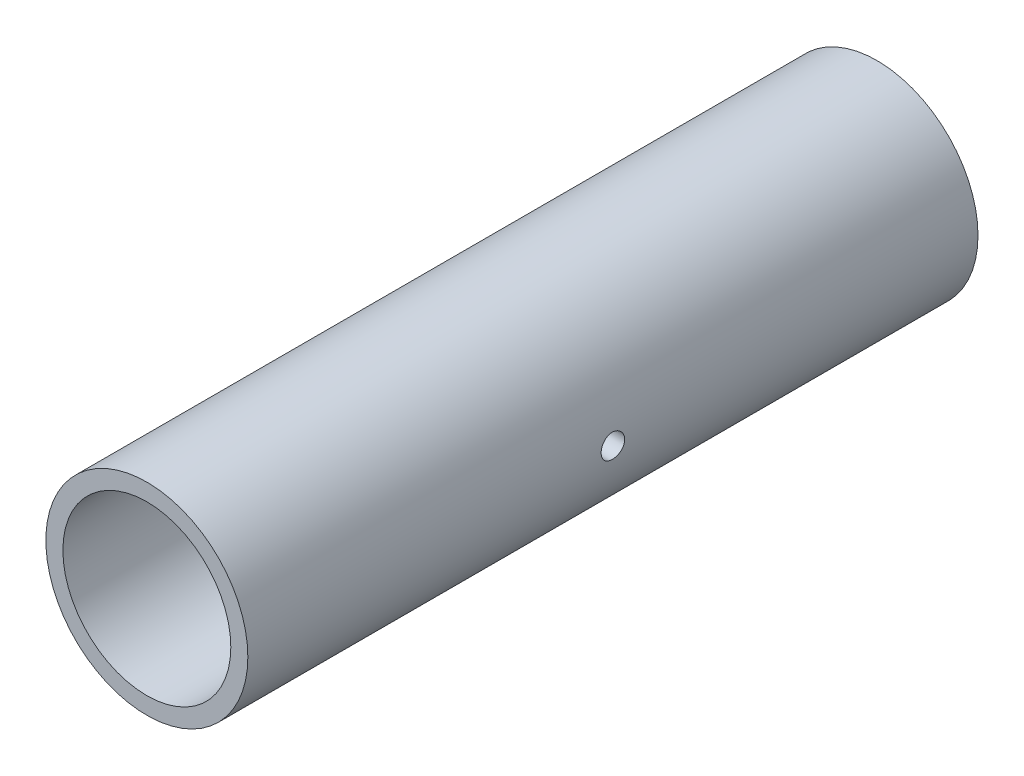
ISO-10303-21;
HEADER;
FILE_DESCRIPTION(('STEP AP214'),'2;1');
FILE_NAME('part.step','',(''),(''),'','','');
FILE_SCHEMA(('AUTOMOTIVE_DESIGN { 1 0 10303 214 1 1 1 1 }'));
ENDSEC;
DATA;
#1=APPLICATION_CONTEXT('core data for automotive mechanical design processes');
#2=APPLICATION_PROTOCOL_DEFINITION('international standard','automotive_design',2000,#1);
#3=PRODUCT_CONTEXT('',#1,'mechanical');
#4=PRODUCT('Part','Part','',(#3));
#5=PRODUCT_RELATED_PRODUCT_CATEGORY('part','',(#4));
#6=PRODUCT_DEFINITION_FORMATION('','',#4);
#7=PRODUCT_DEFINITION_CONTEXT('part definition',#1,'design');
#8=PRODUCT_DEFINITION('design','',#6,#7);
#9=PRODUCT_DEFINITION_SHAPE('','',#8);
#10=(LENGTH_UNIT() NAMED_UNIT(*) SI_UNIT(.MILLI.,.METRE.));
#11=(NAMED_UNIT(*) PLANE_ANGLE_UNIT() SI_UNIT($,.RADIAN.));
#12=(NAMED_UNIT(*) SI_UNIT($,.STERADIAN.) SOLID_ANGLE_UNIT());
#13=UNCERTAINTY_MEASURE_WITH_UNIT(LENGTH_MEASURE(1.E-05),#10,'distance_accuracy_value','');
#14=(GEOMETRIC_REPRESENTATION_CONTEXT(3) GLOBAL_UNCERTAINTY_ASSIGNED_CONTEXT((#13)) GLOBAL_UNIT_ASSIGNED_CONTEXT((#10,
#11,#12)) REPRESENTATION_CONTEXT('',''));
#15=CARTESIAN_POINT('',(0.,0.,0.));
#16=DIRECTION('',(0.,0.,1.));
#17=DIRECTION('',(1.,0.,0.));
#18=AXIS2_PLACEMENT_3D('',#15,#16,#17);
#19=CARTESIAN_POINT('',(-101.6,0.,152.402));
#20=DIRECTION('',(0.,0.,1.));
#21=DIRECTION('',(1.,0.,0.));
#22=AXIS2_PLACEMENT_3D('',#19,#20,#21);
#23=CYLINDRICAL_SURFACE('',#22,17.526);
#24=CARTESIAN_POINT('',(-119.123715355355,0.28297728617745,78.6411031026992));
#25=CARTESIAN_POINT('',(-119.121505128707,0.419725387709833,78.6252451869688));
#26=CARTESIAN_POINT('',(-119.117701917003,0.55519634107018,78.5978624196119));
#27=CARTESIAN_POINT('',(-119.107325190727,0.819641914327255,78.5208303913292));
#28=CARTESIAN_POINT('',(-119.100748768076,0.948609555237474,78.4711577530024));
#29=CARTESIAN_POINT('',(-119.085567784651,1.19623497759444,78.351045765692));
#30=CARTESIAN_POINT('',(-119.07696478105,1.3149005795334,78.2806223507067));
#31=CARTESIAN_POINT('',(-119.058683604987,1.53872445538153,78.1210105871433));
#32=CARTESIAN_POINT('',(-119.049005613146,1.64388499204596,78.0318253886998));
#33=CARTESIAN_POINT('',(-119.02958562624,1.83843862258968,77.8365553481983));
#34=CARTESIAN_POINT('',(-119.019843601335,1.92773147696729,77.7303706023728));
#35=CARTESIAN_POINT('',(-119.001451897443,2.08725094028072,77.504441243093));
#36=CARTESIAN_POINT('',(-118.992802250694,2.15747698658327,77.384696229643));
#37=CARTESIAN_POINT('',(-118.977577993425,2.27686193748739,77.1349453244671));
#38=CARTESIAN_POINT('',(-118.971004142651,2.32601313099119,77.0049356975797));
#39=CARTESIAN_POINT('',(-118.960696061729,2.40174584599649,76.7383948893738));
#40=CARTESIAN_POINT('',(-118.956961657328,2.42832875249076,76.6018641087952));
#41=CARTESIAN_POINT('',(-118.952786075787,2.45799054285402,76.327406279144));
#42=CARTESIAN_POINT('',(-118.952317026263,2.46126835922658,76.1895011353762));
#43=CARTESIAN_POINT('',(-118.954652238211,2.44474718479965,75.9151118442297));
#44=CARTESIAN_POINT('',(-118.957456409832,2.42494882745929,75.7786276579483));
#45=CARTESIAN_POINT('',(-118.965997166519,2.36300228421005,75.5115225938979));
#46=CARTESIAN_POINT('',(-118.971721693318,2.32094597577758,75.3808799897539));
#47=CARTESIAN_POINT('',(-118.985449015432,2.21576961423337,75.1284974499377));
#48=CARTESIAN_POINT('',(-118.993451914927,2.15264859790917,75.0067579216812));
#49=CARTESIAN_POINT('',(-119.010902012579,2.00663639659153,74.7747327311101));
#50=CARTESIAN_POINT('',(-119.020358625173,1.92361421340849,74.6645302238158));
#51=CARTESIAN_POINT('',(-119.039619790398,1.740346604452,74.4595526320331));
#52=CARTESIAN_POINT('',(-119.04942435956,1.64010035951873,74.3647782817107));
#53=CARTESIAN_POINT('',(-119.068360383365,1.42437560126186,74.19266657615));
#54=CARTESIAN_POINT('',(-119.077486575457,1.30879417604439,74.1154575511887));
#55=CARTESIAN_POINT('',(-119.093961421427,1.0661856150858,73.9815536036244));
#56=CARTESIAN_POINT('',(-119.101310119849,0.939158766274965,73.9248581669359));
#57=CARTESIAN_POINT('',(-119.113378473563,0.677716930934977,73.833810640891));
#58=CARTESIAN_POINT('',(-119.118107316093,0.543329601894206,73.7993804005794));
#59=CARTESIAN_POINT('',(-119.124441162939,0.270611487492154,73.7535852573418));
#60=CARTESIAN_POINT('',(-119.126046350755,0.132280934262034,73.7422189995086));
#61=CARTESIAN_POINT('',(-119.125951986942,-0.143137402694307,73.7428928519706));
#62=CARTESIAN_POINT('',(-119.124280497334,-0.280225725804454,73.7547342081212));
#63=CARTESIAN_POINT('',(-119.117875469495,-0.55044219661083,73.8010700059227));
#64=CARTESIAN_POINT('',(-119.113141935451,-0.683570349722479,73.8355644165946));
#65=CARTESIAN_POINT('',(-119.101140462198,-0.942077880844908,73.9261697607615));
#66=CARTESIAN_POINT('',(-119.093873353741,-1.06745978297961,73.9822736092281));
#67=CARTESIAN_POINT('',(-119.077605395029,-1.30706714498407,74.1144876246053));
#68=CARTESIAN_POINT('',(-119.068604449357,-1.42129199032536,74.1905988926692));
#69=CARTESIAN_POINT('',(-119.049777850375,-1.63636768818757,74.3614197407177));
#70=CARTESIAN_POINT('',(-119.039945929669,-1.73709870764936,74.4562795323442));
#71=CARTESIAN_POINT('',(-119.020620344086,-1.92126473598738,74.661553664412));
#72=CARTESIAN_POINT('',(-119.011126689633,-2.0046992122227,74.7719684836891));
#73=CARTESIAN_POINT('',(-118.993507369542,-2.15224104275118,75.0058015387639));
#74=CARTESIAN_POINT('',(-118.98538769137,-2.2162647216069,75.1292730616549));
#75=CARTESIAN_POINT('',(-118.971498120692,-2.32263301614465,75.3853491681182));
#76=CARTESIAN_POINT('',(-118.965728112698,-2.36497869733554,75.5179533024444));
#77=CARTESIAN_POINT('',(-118.957236378841,-2.42651802383966,75.7876052800066));
#78=CARTESIAN_POINT('',(-118.954494837915,-2.44586223076695,75.9246181273913));
#79=CARTESIAN_POINT('',(-118.952310159854,-2.46131525653618,76.1999710553356));
#80=CARTESIAN_POINT('',(-118.952866869435,-2.45742515516648,76.3383110739181));
#81=CARTESIAN_POINT('',(-118.957197628053,-2.42664350766508,76.6113399658756));
#82=CARTESIAN_POINT('',(-118.960948475202,-2.39991783209861,76.7460479601579));
#83=CARTESIAN_POINT('',(-118.971208792187,-2.32448219119439,77.0090485050365));
#84=CARTESIAN_POINT('',(-118.977718331456,-2.27577167252249,77.1373408940688));
#85=CARTESIAN_POINT('',(-118.992789013397,-2.15757050917418,77.3843846643752));
#86=CARTESIAN_POINT('',(-119.00135725346,-2.08800776619924,77.5031010986397));
#87=CARTESIAN_POINT('',(-119.019574195805,-1.93013073629695,77.7272354511105));
#88=CARTESIAN_POINT('',(-119.029222927516,-1.84181593856106,77.8326530069289));
#89=CARTESIAN_POINT('',(-119.048616139759,-1.64803310294449,78.0281557234962));
#90=CARTESIAN_POINT('',(-119.058360727993,-1.54242360941094,78.1181007138414));
#91=CARTESIAN_POINT('',(-119.076772073305,-1.3175064853285,78.2790284888199));
#92=CARTESIAN_POINT('',(-119.085438606464,-1.19819601886243,78.3500073375654));
#93=CARTESIAN_POINT('',(-119.100725507981,-0.949133614688026,78.4709900023214));
#94=CARTESIAN_POINT('',(-119.107344122617,-0.819372847099269,78.5209758541373));
#95=CARTESIAN_POINT('',(-119.117768969297,-0.553273149397818,78.5983551413155));
#96=CARTESIAN_POINT('',(-119.12157822312,-0.416941455751361,78.6257728549007));
#97=CARTESIAN_POINT('',(-119.125262958391,-0.186002191422685,78.6522049553093));
#98=CARTESIAN_POINT('',(-119.126009745135,-0.0920821068849606,78.6575194540336));
#99=CARTESIAN_POINT('',(-119.125990063029,0.0957493223237467,78.6573791778342));
#100=CARTESIAN_POINT('',(-119.125223609408,0.18966066707318,78.6519245112995));
#101=CARTESIAN_POINT('',(-119.123715355355,0.28297728617745,78.6411031026992));
#102=B_SPLINE_CURVE_WITH_KNOTS('',3,(#24,#25,#26,#27,#28,#29,#30,#31,#32,#33,#34,#35,#36,#37,
#38,#39,#40,#41,#42,#43,#44,#45,#46,#47,#48,#49,#50,#51,#52,#53,#54,#55,#56,#57,#58,#59,#60,#61,
#62,#63,#64,#65,#66,#67,#68,#69,#70,#71,#72,#73,#74,#75,#76,#77,#78,#79,#80,#81,#82,#83,#84,#85,
#86,#87,#88,#89,#90,#91,#92,#93,#94,#95,#96,#97,#98,#99,#100,#101),.UNSPECIFIED.,.T.,.F.,(4,2,2,
2,2,2,2,2,2,2,2,2,2,2,2,2,2,2,2,2,2,2,2,2,2,2,2,2,2,2,2,2,2,2,2,2,2,2,4),(0.,0.412702421936888,
0.825838697502058,1.23865855919966,1.65140916300135,2.06668105728181,2.48196520428906,
2.89740117060886,3.31281164020336,3.7246718571969,4.13652076856983,4.54668273916778,
4.95686346755093,5.3698221422834,5.78280046237238,6.1987054322117,6.61459997844877,
7.02902669336666,7.44342906183956,7.8542979198431,8.26516621596913,8.67589991632024,
9.08665622705946,9.50084762558321,9.9150517770901,10.3310168778418,10.7469615312689,
11.160168263129,11.5733557918201,11.9835673219892,12.3937891773039,12.8054460978476,
13.217114233421,13.6323350808814,14.0476420289169,14.4633036441779,14.878517514785,
15.1601476207643,15.4417748922199),.UNSPECIFIED.);
#103=CARTESIAN_POINT('',(-119.123715355355,0.28297728617745,78.6411031026992));
#104=VERTEX_POINT('',#103);
#105=EDGE_CURVE('E57',#104,#104,#102,.T.);
#106=ORIENTED_EDGE('',*,*,#105,.T.);
#107=EDGE_LOOP('',(#106));
#108=FACE_BOUND('',#107,.T.);
#109=CARTESIAN_POINT('',(-84.0762850423931,-0.283001916152178,78.64110024742));
#110=CARTESIAN_POINT('',(-84.0784954591948,-0.419749888550048,78.6252409483634));
#111=CARTESIAN_POINT('',(-84.0822988543719,-0.555220593960883,78.5978568056098));
#112=CARTESIAN_POINT('',(-84.0926759134468,-0.819665441589468,78.5208220838444));
#113=CARTESIAN_POINT('',(-84.0992524853983,-0.948632604553733,78.4711481274089));
#114=CARTESIAN_POINT('',(-84.1144337162636,-1.19625685689019,78.3510335998564));
#115=CARTESIAN_POINT('',(-84.1230368180421,-1.31492176692449,78.2806089626766));
#116=CARTESIAN_POINT('',(-84.1413181283139,-1.53874406469656,78.1209948821109));
#117=CARTESIAN_POINT('',(-84.1509961561948,-1.6439037152455,78.0318085888708));
#118=CARTESIAN_POINT('',(-84.1704161478784,-1.83845539011648,77.8365365142617));
#119=CARTESIAN_POINT('',(-84.1801581411129,-1.92774717488858,77.7303508310793));
#120=CARTESIAN_POINT('',(-84.1985497166852,-2.08726435329467,77.5044197837253));
#121=CARTESIAN_POINT('',(-84.2071992667853,-2.15748918433572,77.3846740195953));
#122=CARTESIAN_POINT('',(-84.2224232728635,-2.27687156766262,77.1349218693825));
#123=CARTESIAN_POINT('',(-84.2289969698236,-2.32602141640575,77.0049117518953));
#124=CARTESIAN_POINT('',(-84.2393047068972,-2.40175137975518,76.7383701984834));
#125=CARTESIAN_POINT('',(-84.2430389212671,-2.42833287937149,76.6018391632879));
#126=CARTESIAN_POINT('',(-84.2472141101466,-2.45799184677201,76.3273810841671));
#127=CARTESIAN_POINT('',(-84.2476829574714,-2.46126824945019,76.1894759437024));
#128=CARTESIAN_POINT('',(-84.2453473513074,-2.44474427560648,75.9150868987981));
#129=CARTESIAN_POINT('',(-84.2425429876635,-2.42494453249069,75.7786029554524));
#130=CARTESIAN_POINT('',(-84.2340018782284,-2.36299528190851,75.5114985605164));
#131=CARTESIAN_POINT('',(-84.2282771896217,-2.32093764438881,75.3808563833333));
#132=CARTESIAN_POINT('',(-84.214549591541,-2.21575871503116,75.12847491152));
#133=CARTESIAN_POINT('',(-84.2065465778866,-2.15263645995401,75.0067360243283));
#134=CARTESIAN_POINT('',(-84.1890963090609,-2.00662187822262,74.7747122875692));
#135=CARTESIAN_POINT('',(-84.1796396395318,-1.92359854966221,74.6645105972246));
#136=CARTESIAN_POINT('',(-84.1603784266853,-1.74032879477084,74.4595348205389));
#137=CARTESIAN_POINT('',(-84.1505738668407,-1.64008154931064,74.364761468351));
#138=CARTESIAN_POINT('',(-84.1316379296155,-1.42435497963203,74.192651942565));
#139=CARTESIAN_POINT('',(-84.1225118150913,-1.30877274791467,74.1154440964136));
#140=CARTESIAN_POINT('',(-84.1060371820802,-1.06616278044245,73.9815426284237));
#141=CARTESIAN_POINT('',(-84.0986886190438,-0.939135331639548,73.9248484924485));
#142=CARTESIAN_POINT('',(-84.0866205804677,-0.677692568924606,73.8338036649881));
#143=CARTESIAN_POINT('',(-84.0818919166868,-0.543304914262008,73.7993748149955));
#144=CARTESIAN_POINT('',(-84.0755584479719,-0.270586391090682,73.7535824831755));
#145=CARTESIAN_POINT('',(-84.073953459538,-0.132255754696432,73.7422176464533));
#146=CARTESIAN_POINT('',(-84.0740482183778,0.143162514084278,73.7428943163731));
#147=CARTESIAN_POINT('',(-84.0757199038749,0.280250687925561,73.7547370705879));
#148=CARTESIAN_POINT('',(-84.0821253001818,0.5504666274621,73.8010756134715));
#149=CARTESIAN_POINT('',(-84.0868590068111,0.683594398564053,73.8355713712132));
#150=CARTESIAN_POINT('',(-84.0988607852353,0.942100994423669,73.9261793361906));
#151=CARTESIAN_POINT('',(-84.1061280271867,1.06748234066341,73.9822844660417));
#152=CARTESIAN_POINT('',(-84.122396197986,1.30708838642506,74.1145009364373));
#153=CARTESIAN_POINT('',(-84.1313972222505,1.42131247139912,74.1906133781439));
#154=CARTESIAN_POINT('',(-84.1502239160137,1.63638646866833,74.3614364533449));
#155=CARTESIAN_POINT('',(-84.160055852446,1.73711654497057,74.4562972990753));
#156=CARTESIAN_POINT('',(-84.1793814022483,1.92128052112988,74.6615733742831));
#157=CARTESIAN_POINT('',(-84.1888750051927,2.0047138883781,74.7719890825578));
#158=CARTESIAN_POINT('',(-84.2064941565148,2.15225333384261,75.0058236907359));
#159=CARTESIAN_POINT('',(-84.2146137175997,2.21627574217744,75.1292958729993));
#160=CARTESIAN_POINT('',(-84.2285030045321,2.32264140127576,75.3853730751431));
#161=CARTESIAN_POINT('',(-84.2342728458733,2.36498571759065,75.5179776457722));
#162=CARTESIAN_POINT('',(-84.2427642159702,2.42652226060056,75.7876302213659));
#163=CARTESIAN_POINT('',(-84.2455055607208,2.44586505482866,75.9246432307593));
#164=CARTESIAN_POINT('',(-84.2476898405201,2.46131525453638,76.1999962391246));
#165=CARTESIAN_POINT('',(-84.2471329288462,2.45742373976591,76.3383361761329));
#166=CARTESIAN_POINT('',(-84.2428017844907,2.42663931456109,76.6113646971601));
#167=CARTESIAN_POINT('',(-84.2390507528871,2.39991226950272,76.746072403234));
#168=CARTESIAN_POINT('',(-84.2287901035937,2.32447396111099,77.0090721477497));
#169=CARTESIAN_POINT('',(-84.222280416466,2.2757621443992,77.1373640246085));
#170=CARTESIAN_POINT('',(-84.207209488404,2.15755846694252,77.3844066044799));
#171=CARTESIAN_POINT('',(-84.1986411495818,2.08799450136079,77.5031223564145));
#172=CARTESIAN_POINT('',(-84.1804240720473,1.93011515120724,77.727255150215));
#173=CARTESIAN_POINT('',(-84.1707753039079,1.8417992558368,77.8326718296923));
#174=CARTESIAN_POINT('',(-84.1513820857751,1.64801437603673,78.0281726071254));
#175=CARTESIAN_POINT('',(-84.1416375286559,1.54240393835226,78.1181165342447));
#176=CARTESIAN_POINT('',(-84.1232263099669,1.31748511144555,78.2790420355909));
#177=CARTESIAN_POINT('',(-84.1145598723268,1.19817388637854,78.3500196739468));
#178=CARTESIAN_POINT('',(-84.099273218963,0.949110220088544,78.4709997786805));
#179=CARTESIAN_POINT('',(-84.0926547562673,0.819348952888068,78.5209842883384));
#180=CARTESIAN_POINT('',(-84.0822302491017,0.553248492077288,78.5983608283505));
#181=CARTESIAN_POINT('',(-84.0784211828135,0.416916534683918,78.6257771370114));
#182=CARTESIAN_POINT('',(-84.0747367749864,0.185977088688456,78.6522068565846));
#183=CARTESIAN_POINT('',(-84.0739901234649,0.0920570207892809,78.6575203911249));
#184=CARTESIAN_POINT('',(-84.0740100736405,-0.0957742633273715,78.657378203161));
#185=CARTESIAN_POINT('',(-84.0747766601074,-0.189685479624424,78.6519225890449));
#186=CARTESIAN_POINT('',(-84.0762850423931,-0.283001916152178,78.64110024742));
#187=B_SPLINE_CURVE_WITH_KNOTS('',3,(#109,#110,#111,#112,#113,#114,#115,#116,#117,#118,#119,
#120,#121,#122,#123,#124,#125,#126,#127,#128,#129,#130,#131,#132,#133,#134,#135,#136,#137,#138,
#139,#140,#141,#142,#143,#144,#145,#146,#147,#148,#149,#150,#151,#152,#153,#154,#155,#156,#157,
#158,#159,#160,#161,#162,#163,#164,#165,#166,#167,#168,#169,#170,#171,#172,#173,#174,#175,#176,
#177,#178,#179,#180,#181,#182,#183,#184,#185,#186),.UNSPECIFIED.,.T.,.F.,(4,2,2,2,2,2,2,2,2,2,2,
2,2,2,2,2,2,2,2,2,2,2,2,2,2,2,2,2,2,2,2,2,2,2,2,2,2,2,4),(0.,0.412702524526835,
0.825838904356855,1.23865887000924,1.65140957703403,2.06668155001412,2.48196577475207,
2.89740166928389,3.31281206684818,3.7246721726169,4.13652097370069,4.54668296782811,
4.95686372034335,5.36982251545837,5.78280095536756,6.19870595614714,6.61460053234832,
7.02902714079223,7.443429403053,7.8542981844852,8.26516640497842,8.67590017440333,
9.08665655451953,9.50084806284988,9.91505232327673,10.3310174042858,10.7469620372432,
11.1601686474057,11.5733560550889,11.9835675530892,12.3937893770945,12.8054464035196,
13.2171146448346,13.6323355722824,14.0476425992907,14.46330414412,14.878517944101,
15.1601478350032,15.4417748914016),.UNSPECIFIED.);
#188=CARTESIAN_POINT('',(-84.0762850423931,-0.283001916152178,78.64110024742));
#189=VERTEX_POINT('',#188);
#190=EDGE_CURVE('E60',#189,#189,#187,.T.);
#191=ORIENTED_EDGE('',*,*,#190,.T.);
#192=EDGE_LOOP('',(#191));
#193=FACE_BOUND('',#192,.T.);
#194=CARTESIAN_POINT('',(-101.6,0.,152.4));
#195=DIRECTION('',(0.,0.,1.));
#196=DIRECTION('',(1.,0.,0.));
#197=AXIS2_PLACEMENT_3D('',#194,#195,#196);
#198=CIRCLE('',#197,17.526);
#199=CARTESIAN_POINT('',(-84.074,0.,152.4));
#200=VERTEX_POINT('',#199);
#201=EDGE_CURVE('E16',#200,#200,#198,.F.);
#202=ORIENTED_EDGE('',*,*,#201,.F.);
#203=EDGE_LOOP('',(#202));
#204=FACE_BOUND('',#203,.T.);
#205=CARTESIAN_POINT('',(-101.6,0.,0.));
#206=DIRECTION('',(0.,0.,1.));
#207=DIRECTION('',(1.,0.,0.));
#208=AXIS2_PLACEMENT_3D('',#205,#206,#207);
#209=CIRCLE('',#208,17.526);
#210=CARTESIAN_POINT('',(-84.074,0.,0.));
#211=VERTEX_POINT('',#210);
#212=EDGE_CURVE('E68',#211,#211,#209,.F.);
#213=ORIENTED_EDGE('',*,*,#212,.T.);
#214=EDGE_LOOP('',(#213));
#215=FACE_BOUND('',#214,.T.);
#216=ADVANCED_FACE('F12',(#108,#193,#204,#215),#23,.F.);
#217=CARTESIAN_POINT('',(-50.8,0.,152.4));
#218=DIRECTION('',(0.,0.,1.));
#219=DIRECTION('',(1.,0.,0.));
#220=AXIS2_PLACEMENT_3D('',#217,#218,#219);
#221=PLANE('',#220);
#222=CARTESIAN_POINT('',(-101.6,0.,152.4));
#223=DIRECTION('',(0.,0.,1.));
#224=DIRECTION('',(1.,0.,0.));
#225=AXIS2_PLACEMENT_3D('',#222,#223,#224);
#226=CIRCLE('',#225,21.082);
#227=CARTESIAN_POINT('',(-80.518,0.,152.4));
#228=VERTEX_POINT('',#227);
#229=EDGE_CURVE('E55',#228,#228,#226,.F.);
#230=ORIENTED_EDGE('',*,*,#229,.F.);
#231=EDGE_LOOP('',(#230));
#232=FACE_BOUND('',#231,.T.);
#233=ORIENTED_EDGE('',*,*,#201,.T.);
#234=EDGE_LOOP('',(#233));
#235=FACE_BOUND('',#234,.T.);
#236=ADVANCED_FACE('F76',(#232,#235),#221,.T.);
#237=CARTESIAN_POINT('',(-50.8,0.,0.));
#238=DIRECTION('',(0.,0.,1.));
#239=DIRECTION('',(1.,0.,0.));
#240=AXIS2_PLACEMENT_3D('',#237,#238,#239);
#241=PLANE('',#240);
#242=ORIENTED_EDGE('',*,*,#212,.F.);
#243=EDGE_LOOP('',(#242));
#244=FACE_BOUND('',#243,.T.);
#245=CARTESIAN_POINT('',(-101.6,0.,0.));
#246=DIRECTION('',(0.,0.,1.));
#247=DIRECTION('',(1.,0.,0.));
#248=AXIS2_PLACEMENT_3D('',#245,#246,#247);
#249=CIRCLE('',#248,21.082);
#250=CARTESIAN_POINT('',(-80.518,0.,0.));
#251=VERTEX_POINT('',#250);
#252=EDGE_CURVE('E25',#251,#251,#249,.T.);
#253=ORIENTED_EDGE('',*,*,#252,.F.);
#254=EDGE_LOOP('',(#253));
#255=FACE_BOUND('',#254,.T.);
#256=ADVANCED_FACE('F72',(#244,#255),#241,.F.);
#257=CARTESIAN_POINT('',(253.461205231018,0.,76.2));
#258=DIRECTION('',(1.,0.,0.));
#259=DIRECTION('',(0.,0.,-1.));
#260=AXIS2_PLACEMENT_3D('',#257,#258,#259);
#261=CYLINDRICAL_SURFACE('',#260,2.45745);
#262=ORIENTED_EDGE('',*,*,#190,.F.);
#263=EDGE_LOOP('',(#262));
#264=FACE_BOUND('',#263,.T.);
#265=CARTESIAN_POINT('',(-80.5181541325682,0.0806524054718056,78.6561262976621));
#266=CARTESIAN_POINT('',(-80.5186820329268,0.21818113823026,78.6516043629974));
#267=CARTESIAN_POINT('',(-80.5205653423464,0.355412558552275,78.6355011391122));
#268=CARTESIAN_POINT('',(-80.5268414048882,0.625290342189116,78.5805619723891));
#269=CARTESIAN_POINT('',(-80.5312368551225,0.757931614791714,78.5417015956605));
#270=CARTESIAN_POINT('',(-80.5420413389724,1.01469521796634,78.4424053118097));
#271=CARTESIAN_POINT('',(-80.5484490387309,1.13882312556343,78.3819836933517));
#272=CARTESIAN_POINT('',(-80.5625641623541,1.37515504325702,78.2413036253));
#273=CARTESIAN_POINT('',(-80.5702713470256,1.48736124157069,78.1610488250915));
#274=CARTESIAN_POINT('',(-80.5861652210386,1.6972376865299,77.9825553244313));
#275=CARTESIAN_POINT('',(-80.5943538625412,1.79484212106605,77.8842394030088));
#276=CARTESIAN_POINT('',(-80.6102618164137,1.97219806321543,77.6726024143905));
#277=CARTESIAN_POINT('',(-80.6179811078424,2.05194877466587,77.5592806783891));
#278=CARTESIAN_POINT('',(-80.6320947067821,2.1914881523434,77.3205348676051));
#279=CARTESIAN_POINT('',(-80.6384860803517,2.25123279088914,77.195084873169));
#280=CARTESIAN_POINT('',(-80.6491915613128,2.34878139995595,76.9358430439173));
#281=CARTESIAN_POINT('',(-80.6535057447501,2.38658617370594,76.802051514688));
#282=CARTESIAN_POINT('',(-80.6595443038576,2.43900391482055,76.5306450045006));
#283=CARTESIAN_POINT('',(-80.6612816597925,2.4537331420238,76.3930527678913));
#284=CARTESIAN_POINT('',(-80.6620083355959,2.45992692249096,76.1173409840133));
#285=CARTESIAN_POINT('',(-80.6609977415278,2.45139220436228,75.9792214533942));
#286=CARTESIAN_POINT('',(-80.6563553814085,2.41140397204797,75.7070168789922));
#287=CARTESIAN_POINT('',(-80.6527352495481,2.38005217805632,75.5729166702725));
#288=CARTESIAN_POINT('',(-80.6432975672866,2.2954617337152,75.3118897213445));
#289=CARTESIAN_POINT('',(-80.6374799674916,2.24222259138742,75.1849631424563));
#290=CARTESIAN_POINT('',(-80.6242808253384,2.11518353206291,74.941437492446));
#291=CARTESIAN_POINT('',(-80.6168944369358,2.04131967682597,74.8248720474254));
#292=CARTESIAN_POINT('',(-80.6013966271366,1.87518524873515,74.6057456635839));
#293=CARTESIAN_POINT('',(-80.593285177781,1.78291396590226,74.5031852651982));
#294=CARTESIAN_POINT('',(-80.57719396226,1.58194447982289,74.3143616262595));
#295=CARTESIAN_POINT('',(-80.5692152337875,1.47315403228345,74.228196441529));
#296=CARTESIAN_POINT('',(-80.5543348389478,1.2425885045133,74.0753435643006));
#297=CARTESIAN_POINT('',(-80.5474331684799,1.12081347372135,74.0086557976461));
#298=CARTESIAN_POINT('',(-80.5354868992848,0.867772457230997,73.896706507092));
#299=CARTESIAN_POINT('',(-80.5304413122901,0.73651156693338,73.8514335772292));
#300=CARTESIAN_POINT('',(-80.5227721872465,0.468180795237927,73.7835944057831));
#301=CARTESIAN_POINT('',(-80.5201485484559,0.331111155705151,73.7610272197427));
#302=CARTESIAN_POINT('',(-80.5176278949946,0.0559307876115056,73.7393359345393));
#303=CARTESIAN_POINT('',(-80.5177146830219,-0.0821688275785562,73.7400725738535));
#304=CARTESIAN_POINT('',(-80.5205649242461,-0.356271048879247,73.7646222788915));
#305=CARTESIAN_POINT('',(-80.5233283411803,-0.492273683374205,73.7884350319823));
#306=CARTESIAN_POINT('',(-80.531213740717,-0.758035437927321,73.8583587668501));
#307=CARTESIAN_POINT('',(-80.5363307177084,-0.887807166325397,73.9044224352063));
#308=CARTESIAN_POINT('',(-80.548353108815,-1.13778894682464,74.0174973515221));
#309=CARTESIAN_POINT('',(-80.5552585821293,-1.25799868225242,74.084509292883));
#310=CARTESIAN_POINT('',(-80.5701312353755,-1.48609944150137,74.2379708768884));
#311=CARTESIAN_POINT('',(-80.578103548405,-1.59392590463898,74.3245159798294));
#312=CARTESIAN_POINT('',(-80.5941939751542,-1.79356882801013,74.514427793945));
#313=CARTESIAN_POINT('',(-80.6023120933954,-1.88538479080073,74.6177950275867));
#314=CARTESIAN_POINT('',(-80.6178202937387,-2.05080772639886,74.8389702147371));
#315=CARTESIAN_POINT('',(-80.6252069929109,-2.12433226925032,74.9568400852234));
#316=CARTESIAN_POINT('',(-80.6383715465846,-2.25053356972907,75.2033405245157));
#317=CARTESIAN_POINT('',(-80.6441494381518,-2.30321080767511,75.3319708453199));
#318=CARTESIAN_POINT('',(-80.6534197165969,-2.38605194799886,75.5959364266346));
#319=CARTESIAN_POINT('',(-80.6569190244545,-2.41628406487001,75.7312500273835));
#320=CARTESIAN_POINT('',(-80.6612576869697,-2.45360033449082,76.0050723799685));
#321=CARTESIAN_POINT('',(-80.6620971435622,-2.46068537431898,76.1435810091547));
#322=CARTESIAN_POINT('',(-80.6610227597245,-2.451524861702,76.419002021869));
#323=CARTESIAN_POINT('',(-80.6591249298107,-2.4354149784089,76.555919003837));
#324=CARTESIAN_POINT('',(-80.6528215599155,-2.38058638682656,76.8250870410262));
#325=CARTESIAN_POINT('',(-80.6484160052328,-2.34186754599468,76.9573380688889));
#326=CARTESIAN_POINT('',(-80.6375934297019,-2.24292153257183,77.2135236201652));
#327=CARTESIAN_POINT('',(-80.631175314688,-2.18268265772798,77.3374535750685));
#328=CARTESIAN_POINT('',(-80.6170498707,-2.0424192263045,77.573473759516));
#329=CARTESIAN_POINT('',(-80.6093425325062,-1.96239452822669,77.6855639043798));
#330=CARTESIAN_POINT('',(-80.5934499466793,-1.78426484864817,77.8954400559313));
#331=CARTESIAN_POINT('',(-80.5852621256568,-1.68605500333695,77.9931368758872));
#332=CARTESIAN_POINT('',(-80.5693669376052,-1.47459030765602,78.1707126465967));
#333=CARTESIAN_POINT('',(-80.5616596825686,-1.36133196945477,78.2505874551587));
#334=CARTESIAN_POINT('',(-80.5475728187095,-1.12265422501987,78.3904094510548));
#335=CARTESIAN_POINT('',(-80.54119670286,-0.997204058784945,78.4503044503515));
#336=CARTESIAN_POINT('',(-80.5305244741435,-0.738024906168539,78.5480890210652));
#337=CARTESIAN_POINT('',(-80.5262260616162,-0.604305258513219,78.5860029310834));
#338=CARTESIAN_POINT('',(-80.5211960850326,-0.378094550537701,78.629936078143));
#339=CARTESIAN_POINT('',(-80.5197517528056,-0.286817202058039,78.6423876308609));
#340=CARTESIAN_POINT('',(-80.518054257809,-0.103431438648689,78.6569947800586));
#341=CARTESIAN_POINT('',(-80.517801087325,-0.0113230291050608,78.6591504432175));
#342=CARTESIAN_POINT('',(-80.5181541325682,0.0806524054718056,78.6561262976621));
#343=B_SPLINE_CURVE_WITH_KNOTS('',3,(#265,#266,#267,#268,#269,#270,#271,#272,#273,#274,#275,
#276,#277,#278,#279,#280,#281,#282,#283,#284,#285,#286,#287,#288,#289,#290,#291,#292,#293,#294,
#295,#296,#297,#298,#299,#300,#301,#302,#303,#304,#305,#306,#307,#308,#309,#310,#311,#312,#313,
#314,#315,#316,#317,#318,#319,#320,#321,#322,#323,#324,#325,#326,#327,#328,#329,#330,#331,#332,
#333,#334,#335,#336,#337,#338,#339,#340,#341,#342),.UNSPECIFIED.,.T.,.F.,(4,2,2,2,2,2,2,2,2,2,2,
2,2,2,2,2,2,2,2,2,2,2,2,2,2,2,2,2,2,2,2,2,2,2,2,2,2,2,4),(0.,0.412475862678864,
0.825395406351388,1.23804181431789,1.65061235014656,2.06498973310445,2.47938559098547,
2.89468751314116,3.30997422993584,3.72316183107196,4.13633649166488,4.54768038539841,
4.95903352572211,5.37167632846335,5.78433505001753,6.19938913129473,6.61444163231142,
7.02927281858883,7.44408674903817,7.85642226038385,8.26875218552683,8.68020918338351,
9.09167980217459,9.50520661401278,9.91874627175548,10.3341170895367,10.7494783366798,
11.1635720048727,11.577649803334,11.9893154409561,12.4009834919493,12.8128757430966,
13.224770939974,13.6391197798613,14.0535648226132,14.4690840866839,14.8841423832491,
15.1599966840804,15.4358491983982),.UNSPECIFIED.);
#344=CARTESIAN_POINT('',(-80.5181541325682,0.0806524054718056,78.6561262976621));
#345=VERTEX_POINT('',#344);
#346=EDGE_CURVE('E20',#345,#345,#343,.T.);
#347=ORIENTED_EDGE('',*,*,#346,.F.);
#348=EDGE_LOOP('',(#347));
#349=FACE_BOUND('',#348,.T.);
#350=ADVANCED_FACE('F45',(#264,#349),#261,.F.);
#351=CARTESIAN_POINT('',(253.461205231018,0.,76.2));
#352=DIRECTION('',(1.,0.,0.));
#353=DIRECTION('',(0.,0.,-1.));
#354=AXIS2_PLACEMENT_3D('',#351,#352,#353);
#355=CYLINDRICAL_SURFACE('',#354,2.45745);
#356=ORIENTED_EDGE('',*,*,#105,.F.);
#357=EDGE_LOOP('',(#356));
#358=FACE_BOUND('',#357,.T.);
#359=CARTESIAN_POINT('',(-122.681845867432,-0.0806524054718475,78.6561262976621));
#360=CARTESIAN_POINT('',(-122.681317967073,-0.218181138230301,78.6516043629974));
#361=CARTESIAN_POINT('',(-122.679434657654,-0.355412558552316,78.6355011391122));
#362=CARTESIAN_POINT('',(-122.673158595112,-0.625290342189156,78.5805619723891));
#363=CARTESIAN_POINT('',(-122.668763144878,-0.757931614791753,78.5417015956605));
#364=CARTESIAN_POINT('',(-122.657958661028,-1.01469521796638,78.4424053118097));
#365=CARTESIAN_POINT('',(-122.651550961269,-1.13882312556347,78.3819836933517));
#366=CARTESIAN_POINT('',(-122.637435837646,-1.37515504325705,78.2413036253));
#367=CARTESIAN_POINT('',(-122.629728652974,-1.48736124157072,78.1610488250915));
#368=CARTESIAN_POINT('',(-122.613834778961,-1.69723768652993,77.9825553244312));
#369=CARTESIAN_POINT('',(-122.605646137459,-1.79484212106609,77.8842394030087));
#370=CARTESIAN_POINT('',(-122.589738183586,-1.97219806321546,77.6726024143905));
#371=CARTESIAN_POINT('',(-122.582018892158,-2.0519487746659,77.559280678389));
#372=CARTESIAN_POINT('',(-122.567905293218,-2.19148815234342,77.3205348676051));
#373=CARTESIAN_POINT('',(-122.561513919648,-2.25123279088916,77.1950848731689));
#374=CARTESIAN_POINT('',(-122.550808438687,-2.34878139995596,76.9358430439173));
#375=CARTESIAN_POINT('',(-122.54649425525,-2.38658617370595,76.802051514688));
#376=CARTESIAN_POINT('',(-122.540455696142,-2.43900391482055,76.5306450045005));
#377=CARTESIAN_POINT('',(-122.538718340207,-2.4537331420238,76.3930527678913));
#378=CARTESIAN_POINT('',(-122.537991664404,-2.45992692249096,76.1173409840132));
#379=CARTESIAN_POINT('',(-122.539002258472,-2.45139220436228,75.9792214533941));
#380=CARTESIAN_POINT('',(-122.543644618592,-2.41140397204796,75.7070168789922));
#381=CARTESIAN_POINT('',(-122.547264750452,-2.38005217805631,75.5729166702725));
#382=CARTESIAN_POINT('',(-122.556702432713,-2.29546173371518,75.3118897213445));
#383=CARTESIAN_POINT('',(-122.562520032508,-2.2422225913874,75.1849631424563));
#384=CARTESIAN_POINT('',(-122.575719174662,-2.11518353206289,74.941437492446));
#385=CARTESIAN_POINT('',(-122.583105563064,-2.04131967682595,74.8248720474254));
#386=CARTESIAN_POINT('',(-122.598603372863,-1.87518524873514,74.6057456635839));
#387=CARTESIAN_POINT('',(-122.606714822219,-1.78291396590224,74.5031852651982));
#388=CARTESIAN_POINT('',(-122.62280603774,-1.58194447982287,74.3143616262595));
#389=CARTESIAN_POINT('',(-122.630784766212,-1.47315403228342,74.228196441529));
#390=CARTESIAN_POINT('',(-122.645665161052,-1.24258850451327,74.0753435643006));
#391=CARTESIAN_POINT('',(-122.65256683152,-1.12081347372132,74.0086557976461));
#392=CARTESIAN_POINT('',(-122.664513100715,-0.867772457230965,73.896706507092));
#393=CARTESIAN_POINT('',(-122.66955868771,-0.73651156693335,73.8514335772292));
#394=CARTESIAN_POINT('',(-122.677227812753,-0.468180795237896,73.7835944057831));
#395=CARTESIAN_POINT('',(-122.679851451544,-0.331111155705118,73.7610272197427));
#396=CARTESIAN_POINT('',(-122.682372105005,-0.0559307876114707,73.7393359345393));
#397=CARTESIAN_POINT('',(-122.682285316978,0.0821688275785915,73.7400725738535));
#398=CARTESIAN_POINT('',(-122.679435075754,0.356271048879283,73.7646222788915));
#399=CARTESIAN_POINT('',(-122.67667165882,0.492273683374241,73.7884350319824));
#400=CARTESIAN_POINT('',(-122.668786259283,0.758035437927354,73.8583587668501));
#401=CARTESIAN_POINT('',(-122.663669282292,0.887807166325428,73.9044224352063));
#402=CARTESIAN_POINT('',(-122.651646891185,1.13778894682467,74.0174973515221));
#403=CARTESIAN_POINT('',(-122.644741417871,1.25799868225245,74.084509292883));
#404=CARTESIAN_POINT('',(-122.629868764625,1.4860994415014,74.2379708768884));
#405=CARTESIAN_POINT('',(-122.621896451595,1.59392590463901,74.3245159798295));
#406=CARTESIAN_POINT('',(-122.605806024846,1.79356882801017,74.514427793945));
#407=CARTESIAN_POINT('',(-122.597687906605,1.88538479080076,74.6177950275868));
#408=CARTESIAN_POINT('',(-122.582179706261,2.05080772639889,74.8389702147372));
#409=CARTESIAN_POINT('',(-122.574793007089,2.12433226925034,74.9568400852234));
#410=CARTESIAN_POINT('',(-122.561628453415,2.25053356972908,75.2033405245157));
#411=CARTESIAN_POINT('',(-122.555850561848,2.30321080767512,75.3319708453199));
#412=CARTESIAN_POINT('',(-122.546580283403,2.38605194799887,75.5959364266346));
#413=CARTESIAN_POINT('',(-122.543080975545,2.41628406487002,75.7312500273836));
#414=CARTESIAN_POINT('',(-122.53874231303,2.45360033449082,76.0050723799686));
#415=CARTESIAN_POINT('',(-122.537902856438,2.46068537431898,76.1435810091548));
#416=CARTESIAN_POINT('',(-122.538977240276,2.451524861702,76.419002021869));
#417=CARTESIAN_POINT('',(-122.540875070189,2.43541497840889,76.555919003837));
#418=CARTESIAN_POINT('',(-122.547178440084,2.38058638682655,76.8250870410263));
#419=CARTESIAN_POINT('',(-122.551583994767,2.34186754599467,76.957338068889));
#420=CARTESIAN_POINT('',(-122.562406570298,2.24292153257181,77.2135236201653));
#421=CARTESIAN_POINT('',(-122.568824685312,2.18268265772796,77.3374535750685));
#422=CARTESIAN_POINT('',(-122.5829501293,2.04241922630449,77.573473759516));
#423=CARTESIAN_POINT('',(-122.590657467494,1.96239452822667,77.6855639043798));
#424=CARTESIAN_POINT('',(-122.606550053321,1.78426484864815,77.8954400559314));
#425=CARTESIAN_POINT('',(-122.614737874343,1.68605500333693,77.9931368758872));
#426=CARTESIAN_POINT('',(-122.630633062395,1.47459030765598,78.1707126465967));
#427=CARTESIAN_POINT('',(-122.638340317431,1.36133196945473,78.2505874551588));
#428=CARTESIAN_POINT('',(-122.652427181291,1.12265422501982,78.3904094510548));
#429=CARTESIAN_POINT('',(-122.65880329714,0.997204058784905,78.4503044503516));
#430=CARTESIAN_POINT('',(-122.669475525856,0.738024906168501,78.5480890210652));
#431=CARTESIAN_POINT('',(-122.673773938384,0.604305258513184,78.5860029310834));
#432=CARTESIAN_POINT('',(-122.678803914967,0.378094550537664,78.629936078143));
#433=CARTESIAN_POINT('',(-122.680248247194,0.286817202058,78.6423876308609));
#434=CARTESIAN_POINT('',(-122.681945742191,0.103431438648648,78.6569947800586));
#435=CARTESIAN_POINT('',(-122.682198912675,0.0113230291050192,78.6591504432175));
#436=CARTESIAN_POINT('',(-122.681845867432,-0.0806524054718475,78.6561262976621));
#437=B_SPLINE_CURVE_WITH_KNOTS('',3,(#359,#360,#361,#362,#363,#364,#365,#366,#367,#368,#369,
#370,#371,#372,#373,#374,#375,#376,#377,#378,#379,#380,#381,#382,#383,#384,#385,#386,#387,#388,
#389,#390,#391,#392,#393,#394,#395,#396,#397,#398,#399,#400,#401,#402,#403,#404,#405,#406,#407,
#408,#409,#410,#411,#412,#413,#414,#415,#416,#417,#418,#419,#420,#421,#422,#423,#424,#425,#426,
#427,#428,#429,#430,#431,#432,#433,#434,#435,#436),.UNSPECIFIED.,.T.,.F.,(4,2,2,2,2,2,2,2,2,2,2,
2,2,2,2,2,2,2,2,2,2,2,2,2,2,2,2,2,2,2,2,2,2,2,2,2,2,2,4),(0.,0.412475862678861,
0.825395406351387,1.2380418143179,1.65061235014656,2.06498973310446,2.47938559098548,
2.89468751314116,3.30997422993584,3.72316183107195,4.13633649166488,4.5476803853984,
4.95903352572212,5.37167632846333,5.78433505001751,6.19938913129472,6.61444163231141,
7.02927281858882,7.44408674903816,7.85642226038384,8.26875218552682,8.6802091833835,
9.09167980217458,9.50520661401277,9.91874627175547,10.3341170895367,10.7494783366798,
11.1635720048728,11.577649803334,11.9893154409561,12.4009834919493,12.8128757430966,
13.224770939974,13.6391197798613,14.0535648226132,14.4690840866839,14.8841423832491,
15.1599966840804,15.4358491983982),.UNSPECIFIED.);
#438=CARTESIAN_POINT('',(-122.681845867432,-0.0806524054718475,78.6561262976621));
#439=VERTEX_POINT('',#438);
#440=EDGE_CURVE('E8',#439,#439,#437,.T.);
#441=ORIENTED_EDGE('',*,*,#440,.F.);
#442=EDGE_LOOP('',(#441));
#443=FACE_BOUND('',#442,.T.);
#444=ADVANCED_FACE('F35',(#358,#443),#355,.F.);
#445=CARTESIAN_POINT('',(-101.6,0.,152.402));
#446=DIRECTION('',(0.,0.,1.));
#447=DIRECTION('',(1.,0.,0.));
#448=AXIS2_PLACEMENT_3D('',#445,#446,#447);
#449=CYLINDRICAL_SURFACE('',#448,21.082);
#450=ORIENTED_EDGE('',*,*,#440,.T.);
#451=EDGE_LOOP('',(#450));
#452=FACE_BOUND('',#451,.T.);
#453=ORIENTED_EDGE('',*,*,#346,.T.);
#454=EDGE_LOOP('',(#453));
#455=FACE_BOUND('',#454,.T.);
#456=ORIENTED_EDGE('',*,*,#252,.T.);
#457=EDGE_LOOP('',(#456));
#458=FACE_BOUND('',#457,.T.);
#459=ORIENTED_EDGE('',*,*,#229,.T.);
#460=EDGE_LOOP('',(#459));
#461=FACE_BOUND('',#460,.T.);
#462=ADVANCED_FACE('F37',(#452,#455,#458,#461),#449,.T.);
#463=CLOSED_SHELL('',(#216,#236,#256,#350,#444,#462));
#464=MANIFOLD_SOLID_BREP('B1',#463);
#465=ADVANCED_BREP_SHAPE_REPRESENTATION('',(#18,#464),#14);
#466=SHAPE_DEFINITION_REPRESENTATION(#9,#465);
ENDSEC;
END-ISO-10303-21;
